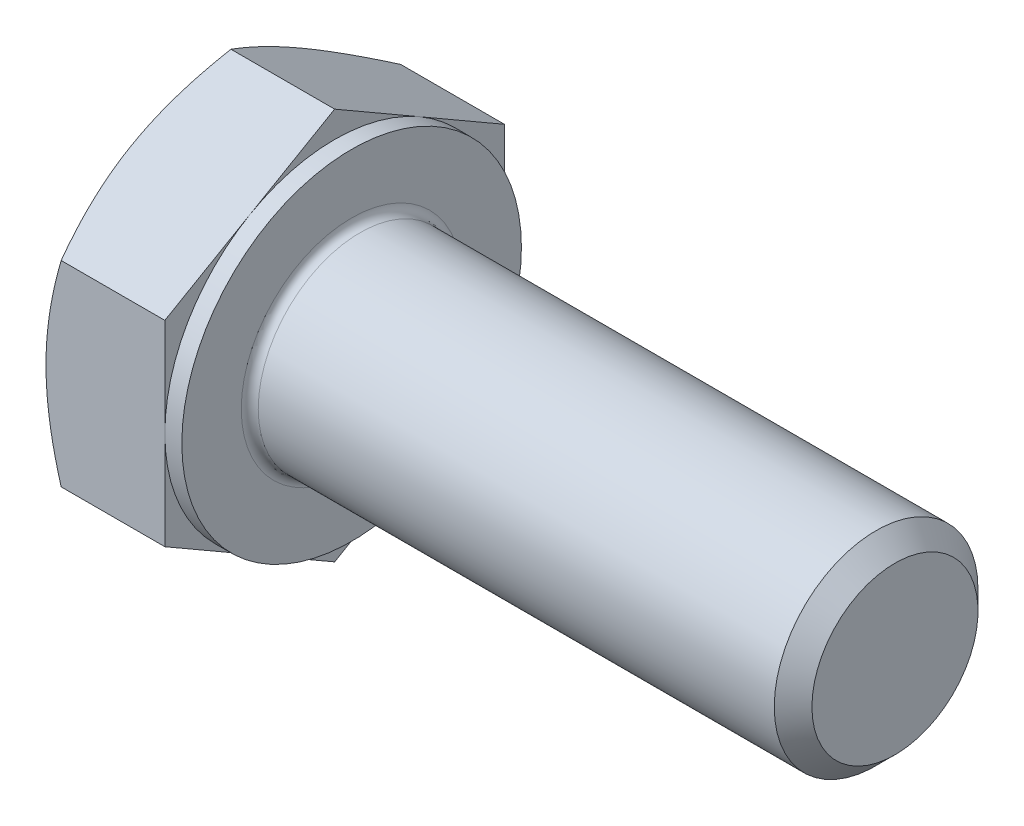
ISO-10303-21;
HEADER;
FILE_DESCRIPTION(('STEP AP214'),'2;1');
FILE_NAME('part.step','',(''),(''),'','','');
FILE_SCHEMA(('AUTOMOTIVE_DESIGN { 1 0 10303 214 1 1 1 1 }'));
ENDSEC;
DATA;
#1=APPLICATION_CONTEXT('core data for automotive mechanical design processes');
#2=APPLICATION_PROTOCOL_DEFINITION('international standard','automotive_design',2000,#1);
#3=PRODUCT_CONTEXT('',#1,'mechanical');
#4=PRODUCT('Part','Part','',(#3));
#5=PRODUCT_RELATED_PRODUCT_CATEGORY('part','',(#4));
#6=PRODUCT_DEFINITION_FORMATION('','',#4);
#7=PRODUCT_DEFINITION_CONTEXT('part definition',#1,'design');
#8=PRODUCT_DEFINITION('design','',#6,#7);
#9=PRODUCT_DEFINITION_SHAPE('','',#8);
#10=(LENGTH_UNIT() NAMED_UNIT(*) SI_UNIT(.MILLI.,.METRE.));
#11=(NAMED_UNIT(*) PLANE_ANGLE_UNIT() SI_UNIT($,.RADIAN.));
#12=(NAMED_UNIT(*) SI_UNIT($,.STERADIAN.) SOLID_ANGLE_UNIT());
#13=UNCERTAINTY_MEASURE_WITH_UNIT(LENGTH_MEASURE(1.E-05),#10,'distance_accuracy_value','');
#14=(GEOMETRIC_REPRESENTATION_CONTEXT(3) GLOBAL_UNCERTAINTY_ASSIGNED_CONTEXT((#13)) GLOBAL_UNIT_ASSIGNED_CONTEXT((#10,
#11,#12)) REPRESENTATION_CONTEXT('',''));
#15=CARTESIAN_POINT('',(0.,0.,0.));
#16=DIRECTION('',(0.,0.,1.));
#17=DIRECTION('',(1.,0.,0.));
#18=AXIS2_PLACEMENT_3D('',#15,#16,#17);
#19=CARTESIAN_POINT('',(4.,5.77350269189626,0.));
#20=DIRECTION('',(1.,0.,0.));
#21=DIRECTION('',(0.,0.,-1.));
#22=AXIS2_PLACEMENT_3D('',#19,#20,#21);
#23=PLANE('',#22);
#24=CARTESIAN_POINT('',(4.,0.,0.));
#25=DIRECTION('',(1.,0.,0.));
#26=DIRECTION('',(0.,0.,-1.));
#27=AXIS2_PLACEMENT_3D('',#24,#25,#26);
#28=CIRCLE('',#27,3.25);
#29=CARTESIAN_POINT('',(4.,0.,-3.25));
#30=VERTEX_POINT('',#29);
#31=EDGE_CURVE('E48',#30,#30,#28,.F.);
#32=ORIENTED_EDGE('',*,*,#31,.T.);
#33=EDGE_LOOP('',(#32));
#34=FACE_BOUND('',#33,.T.);
#35=CARTESIAN_POINT('',(4.,0.,0.));
#36=DIRECTION('',(1.,0.,0.));
#37=DIRECTION('',(0.,0.,-1.));
#38=AXIS2_PLACEMENT_3D('',#35,#36,#37);
#39=CIRCLE('',#38,5.);
#40=CARTESIAN_POINT('',(4.,0.,-5.));
#41=VERTEX_POINT('',#40);
#42=EDGE_CURVE('E305',#41,#41,#39,.T.);
#43=ORIENTED_EDGE('',*,*,#42,.T.);
#44=EDGE_LOOP('',(#43));
#45=FACE_BOUND('',#44,.T.);
#46=ADVANCED_FACE('F40',(#34,#45),#23,.T.);
#47=CARTESIAN_POINT('',(0.,0.,0.));
#48=DIRECTION('',(-1.,0.,0.));
#49=DIRECTION('',(0.,0.,1.));
#50=AXIS2_PLACEMENT_3D('',#47,#48,#49);
#51=CYLINDRICAL_SURFACE('',#50,3.);
#52=CARTESIAN_POINT('',(4.25,0.,0.));
#53=DIRECTION('',(1.,0.,0.));
#54=DIRECTION('',(0.,0.,-1.));
#55=AXIS2_PLACEMENT_3D('',#52,#53,#54);
#56=CIRCLE('',#55,3.);
#57=CARTESIAN_POINT('',(4.25,0.,-3.));
#58=VERTEX_POINT('',#57);
#59=EDGE_CURVE('E11',#58,#58,#56,.T.);
#60=ORIENTED_EDGE('',*,*,#59,.T.);
#61=EDGE_LOOP('',(#60));
#62=FACE_BOUND('',#61,.T.);
#63=CARTESIAN_POINT('',(19.4455,0.,0.));
#64=DIRECTION('',(-1.,0.,0.));
#65=DIRECTION('',(0.,0.,1.));
#66=AXIS2_PLACEMENT_3D('',#63,#64,#65);
#67=CIRCLE('',#66,3.);
#68=CARTESIAN_POINT('',(19.4455,0.,3.));
#69=VERTEX_POINT('',#68);
#70=EDGE_CURVE('E284',#69,#69,#67,.T.);
#71=ORIENTED_EDGE('',*,*,#70,.T.);
#72=EDGE_LOOP('',(#71));
#73=FACE_BOUND('',#72,.T.);
#74=ADVANCED_FACE('F258',(#62,#73),#51,.T.);
#75=CARTESIAN_POINT('',(20.,0.,0.));
#76=DIRECTION('',(-1.,0.,0.));
#77=DIRECTION('',(0.,0.,1.));
#78=AXIS2_PLACEMENT_3D('',#75,#76,#77);
#79=CONICAL_SURFACE('',#78,2.4455,0.785398163397442);
#80=ORIENTED_EDGE('',*,*,#70,.F.);
#81=EDGE_LOOP('',(#80));
#82=FACE_BOUND('',#81,.T.);
#83=CARTESIAN_POINT('',(20.,0.,0.));
#84=DIRECTION('',(-1.,0.,0.));
#85=DIRECTION('',(0.,0.,1.));
#86=AXIS2_PLACEMENT_3D('',#83,#84,#85);
#87=CIRCLE('',#86,2.4455);
#88=CARTESIAN_POINT('',(20.,0.,2.4455));
#89=VERTEX_POINT('',#88);
#90=EDGE_CURVE('E282',#89,#89,#87,.T.);
#91=ORIENTED_EDGE('',*,*,#90,.T.);
#92=EDGE_LOOP('',(#91));
#93=FACE_BOUND('',#92,.T.);
#94=ADVANCED_FACE('F263',(#82,#93),#79,.T.);
#95=CARTESIAN_POINT('',(20.,0.,0.));
#96=DIRECTION('',(-1.,0.,0.));
#97=DIRECTION('',(0.,0.,1.));
#98=AXIS2_PLACEMENT_3D('',#95,#96,#97);
#99=PLANE('',#98);
#100=ORIENTED_EDGE('',*,*,#90,.F.);
#101=EDGE_LOOP('',(#100));
#102=FACE_BOUND('',#101,.T.);
#103=ADVANCED_FACE('F270',(#102),#99,.F.);
#104=CARTESIAN_POINT('',(3.5,5.,0.));
#105=DIRECTION('',(1.,0.,0.));
#106=DIRECTION('',(0.,0.,-1.));
#107=AXIS2_PLACEMENT_3D('',#104,#105,#106);
#108=PLANE('',#107);
#109=DIRECTION('',(0.,0.500000000000001,0.866025403784438));
#110=VECTOR('',#109,1.);
#111=CARTESIAN_POINT('',(3.5,2.88675134594812,-5.));
#112=LINE('',#111,#110);
#113=CARTESIAN_POINT('',(3.5,2.88675134594812,-5.));
#114=VERTEX_POINT('',#113);
#115=CARTESIAN_POINT('',(3.5,4.33012701892219,-2.50000000000001));
#116=VERTEX_POINT('',#115);
#117=EDGE_CURVE('E172',#114,#116,#112,.T.);
#118=ORIENTED_EDGE('',*,*,#117,.T.);
#119=CARTESIAN_POINT('',(3.5,0.,0.));
#120=DIRECTION('',(-1.,0.,0.));
#121=DIRECTION('',(0.,0.,1.));
#122=AXIS2_PLACEMENT_3D('',#119,#120,#121);
#123=CIRCLE('',#122,5.);
#124=CARTESIAN_POINT('',(3.5,0.,-5.));
#125=VERTEX_POINT('',#124);
#126=EDGE_CURVE('E55',#116,#125,#123,.T.);
#127=ORIENTED_EDGE('',*,*,#126,.T.);
#128=DIRECTION('',(0.,1.,0.));
#129=VECTOR('',#128,1.);
#130=CARTESIAN_POINT('',(3.5,2.88675134594812,-5.));
#131=LINE('',#130,#129);
#132=EDGE_CURVE('E308',#125,#114,#131,.T.);
#133=ORIENTED_EDGE('',*,*,#132,.T.);
#134=EDGE_LOOP('',(#118,#127,#133));
#135=FACE_BOUND('',#134,.T.);
#136=ADVANCED_FACE('F273',(#135),#108,.T.);
#137=CARTESIAN_POINT('',(3.5,5.77350269189626,0.));
#138=VERTEX_POINT('',#137);
#139=EDGE_CURVE('E170',#116,#138,#112,.T.);
#140=ORIENTED_EDGE('',*,*,#139,.T.);
#141=DIRECTION('',(0.,-0.500000000000001,0.866025403784438));
#142=VECTOR('',#141,1.);
#143=CARTESIAN_POINT('',(3.5,5.77350269189626,0.));
#144=LINE('',#143,#142);
#145=CARTESIAN_POINT('',(3.5,4.33012701892219,2.50000000000001));
#146=VERTEX_POINT('',#145);
#147=EDGE_CURVE('E169',#138,#146,#144,.T.);
#148=ORIENTED_EDGE('',*,*,#147,.T.);
#149=EDGE_CURVE('E158',#146,#116,#123,.T.);
#150=ORIENTED_EDGE('',*,*,#149,.T.);
#151=EDGE_LOOP('',(#140,#148,#150));
#152=FACE_BOUND('',#151,.T.);
#153=ADVANCED_FACE('F278',(#152),#108,.T.);
#154=CARTESIAN_POINT('',(3.5,2.88675134594812,5.));
#155=VERTEX_POINT('',#154);
#156=EDGE_CURVE('E137',#146,#155,#144,.T.);
#157=ORIENTED_EDGE('',*,*,#156,.T.);
#158=DIRECTION('',(0.,-1.,0.));
#159=VECTOR('',#158,1.);
#160=CARTESIAN_POINT('',(3.5,2.88675134594812,5.));
#161=LINE('',#160,#159);
#162=CARTESIAN_POINT('',(3.5,0.,5.));
#163=VERTEX_POINT('',#162);
#164=EDGE_CURVE('E131',#155,#163,#161,.T.);
#165=ORIENTED_EDGE('',*,*,#164,.T.);
#166=EDGE_CURVE('E135',#163,#146,#123,.T.);
#167=ORIENTED_EDGE('',*,*,#166,.T.);
#168=EDGE_LOOP('',(#157,#165,#167));
#169=FACE_BOUND('',#168,.T.);
#170=ADVANCED_FACE('F133',(#169),#108,.T.);
#171=CARTESIAN_POINT('',(3.5,-2.88675134594812,5.));
#172=VERTEX_POINT('',#171);
#173=EDGE_CURVE('E141',#163,#172,#161,.T.);
#174=ORIENTED_EDGE('',*,*,#173,.T.);
#175=DIRECTION('',(0.,-0.500000000000002,-0.866025403784437));
#176=VECTOR('',#175,1.);
#177=CARTESIAN_POINT('',(3.5,-5.77350269189626,0.));
#178=LINE('',#177,#176);
#179=CARTESIAN_POINT('',(3.5,-4.33012701892219,2.50000000000001));
#180=VERTEX_POINT('',#179);
#181=EDGE_CURVE('E148',#172,#180,#178,.T.);
#182=ORIENTED_EDGE('',*,*,#181,.T.);
#183=EDGE_CURVE('E145',#180,#163,#123,.T.);
#184=ORIENTED_EDGE('',*,*,#183,.T.);
#185=EDGE_LOOP('',(#174,#182,#184));
#186=FACE_BOUND('',#185,.T.);
#187=ADVANCED_FACE('F146',(#186),#108,.T.);
#188=CARTESIAN_POINT('',(3.5,-5.77350269189626,0.));
#189=VERTEX_POINT('',#188);
#190=EDGE_CURVE('E164',#180,#189,#178,.T.);
#191=ORIENTED_EDGE('',*,*,#190,.T.);
#192=DIRECTION('',(0.,0.5,-0.866025403784439));
#193=VECTOR('',#192,1.);
#194=CARTESIAN_POINT('',(3.5,-2.88675134594813,-5.));
#195=LINE('',#194,#193);
#196=CARTESIAN_POINT('',(3.5,-4.33012701892219,-2.5));
#197=VERTEX_POINT('',#196);
#198=EDGE_CURVE('E346',#189,#197,#195,.T.);
#199=ORIENTED_EDGE('',*,*,#198,.T.);
#200=EDGE_CURVE('E152',#197,#180,#123,.T.);
#201=ORIENTED_EDGE('',*,*,#200,.T.);
#202=EDGE_LOOP('',(#191,#199,#201));
#203=FACE_BOUND('',#202,.T.);
#204=ADVANCED_FACE('F347',(#203),#108,.T.);
#205=CARTESIAN_POINT('',(3.5,-2.88675134594814,-5.));
#206=VERTEX_POINT('',#205);
#207=EDGE_CURVE('E159',#197,#206,#195,.T.);
#208=ORIENTED_EDGE('',*,*,#207,.T.);
#209=EDGE_CURVE('E309',#206,#125,#131,.T.);
#210=ORIENTED_EDGE('',*,*,#209,.T.);
#211=EDGE_CURVE('E316',#125,#197,#123,.T.);
#212=ORIENTED_EDGE('',*,*,#211,.T.);
#213=EDGE_LOOP('',(#208,#210,#212));
#214=FACE_BOUND('',#213,.T.);
#215=ADVANCED_FACE('F279',(#214),#108,.T.);
#216=CARTESIAN_POINT('',(0.,0.,0.));
#217=DIRECTION('',(-1.,0.,0.));
#218=DIRECTION('',(0.,0.,1.));
#219=AXIS2_PLACEMENT_3D('',#216,#217,#218);
#220=CYLINDRICAL_SURFACE('',#219,5.);
#221=ORIENTED_EDGE('',*,*,#126,.F.);
#222=ORIENTED_EDGE('',*,*,#149,.F.);
#223=ORIENTED_EDGE('',*,*,#166,.F.);
#224=ORIENTED_EDGE('',*,*,#183,.F.);
#225=ORIENTED_EDGE('',*,*,#200,.F.);
#226=ORIENTED_EDGE('',*,*,#211,.F.);
#227=EDGE_LOOP('',(#221,#222,#223,#224,#225,#226));
#228=FACE_BOUND('',#227,.T.);
#229=ORIENTED_EDGE('',*,*,#42,.F.);
#230=EDGE_LOOP('',(#229));
#231=FACE_BOUND('',#230,.T.);
#232=ADVANCED_FACE('F155',(#228,#231),#220,.T.);
#233=CARTESIAN_POINT('',(0.,5.77350269189626,0.));
#234=DIRECTION('',(1.,0.,0.));
#235=DIRECTION('',(0.,0.,-1.));
#236=AXIS2_PLACEMENT_3D('',#233,#234,#235);
#237=PLANE('',#236);
#238=CARTESIAN_POINT('',(0.,0.,0.));
#239=DIRECTION('',(1.,0.,0.));
#240=DIRECTION('',(0.,0.,-1.));
#241=AXIS2_PLACEMENT_3D('',#238,#239,#240);
#242=CIRCLE('',#241,5.);
#243=CARTESIAN_POINT('',(0.,0.,-5.));
#244=VERTEX_POINT('',#243);
#245=CARTESIAN_POINT('',(0.,4.33012701892219,-2.50000000000001));
#246=VERTEX_POINT('',#245);
#247=EDGE_CURVE('E304',#244,#246,#242,.T.);
#248=ORIENTED_EDGE('',*,*,#247,.F.);
#249=CARTESIAN_POINT('',(0.,-4.33012701892219,-2.5));
#250=VERTEX_POINT('',#249);
#251=EDGE_CURVE('E300',#250,#244,#242,.T.);
#252=ORIENTED_EDGE('',*,*,#251,.F.);
#253=CARTESIAN_POINT('',(0.,-4.33012701892219,2.50000000000001));
#254=VERTEX_POINT('',#253);
#255=EDGE_CURVE('E303',#254,#250,#242,.T.);
#256=ORIENTED_EDGE('',*,*,#255,.F.);
#257=CARTESIAN_POINT('',(0.,0.,5.));
#258=VERTEX_POINT('',#257);
#259=EDGE_CURVE('E339',#258,#254,#242,.T.);
#260=ORIENTED_EDGE('',*,*,#259,.F.);
#261=CARTESIAN_POINT('',(0.,0.,0.));
#262=DIRECTION('',(-1.,0.,0.));
#263=DIRECTION('',(0.,0.,1.));
#264=AXIS2_PLACEMENT_3D('',#261,#262,#263);
#265=CIRCLE('',#264,5.);
#266=CARTESIAN_POINT('',(0.,4.33012701892219,2.50000000000001));
#267=VERTEX_POINT('',#266);
#268=EDGE_CURVE('E173',#258,#267,#265,.T.);
#269=ORIENTED_EDGE('',*,*,#268,.T.);
#270=EDGE_CURVE('E362',#246,#267,#242,.T.);
#271=ORIENTED_EDGE('',*,*,#270,.F.);
#272=EDGE_LOOP('',(#248,#252,#256,#260,#269,#271));
#273=FACE_BOUND('',#272,.T.);
#274=ADVANCED_FACE('F204',(#273),#237,.F.);
#275=CARTESIAN_POINT('',(0.,0.,0.));
#276=DIRECTION('',(1.,0.,0.));
#277=DIRECTION('',(0.,0.,-1.));
#278=AXIS2_PLACEMENT_3D('',#275,#276,#277);
#279=CONICAL_SURFACE('',#278,5.,1.0471975511966);
#280=CARTESIAN_POINT('',(0.446648656051827,2.88663587589429,5.0002));
#281=CARTESIAN_POINT('',(0.373386567637633,3.01349970319368,4.78046540547482));
#282=CARTESIAN_POINT('',(0.30675132191809,3.14144859993849,4.55885141554042));
#283=CARTESIAN_POINT('',(0.19043899101081,3.3995619353212,4.11178600454649));
#284=CARTESIAN_POINT('',(0.140803049915788,3.52973095989717,3.88632664040923));
#285=CARTESIAN_POINT('',(0.0635510254186975,3.78847564779797,3.43816769477649));
#286=CARTESIAN_POINT('',(0.0354203782834891,3.91701101576052,3.21553790689581));
#287=CARTESIAN_POINT('',(0.0101949219536842,4.11026620624322,2.88081009815336));
#288=CARTESIAN_POINT('',(0.00461345976948367,4.17472868879311,2.76915780319494));
#289=CARTESIAN_POINT('',(-0.000797783248530101,4.30371322717528,2.5457500293262));
#290=CARTESIAN_POINT('',(-0.000627741741796917,4.36823528110589,2.43399455370969));
#291=CARTESIAN_POINT('',(0.00775363179203665,4.54500768479194,2.12781576914936));
#292=CARTESIAN_POINT('',(0.0218297718972523,4.65719946015292,1.93349391403279));
#293=CARTESIAN_POINT('',(0.0664652571094321,4.88083840557981,1.54613989800229));
#294=CARTESIAN_POINT('',(0.0970398601475091,4.9922847895602,1.35310909862843));
#295=CARTESIAN_POINT('',(0.173468493621165,5.21637431361295,0.964974657525146));
#296=CARTESIAN_POINT('',(0.219646378878682,5.32898917185759,0.769920001358264));
#297=CARTESIAN_POINT('',(0.324451794491936,5.55253939626498,0.382719654641231));
#298=CARTESIAN_POINT('',(0.383054703437377,5.66347762579592,0.190569004591913));
#299=CARTESIAN_POINT('',(0.446648656051831,5.7736181619501,-0.000200000000000734));
#300=B_SPLINE_CURVE_WITH_KNOTS('',3,(#280,#281,#282,#283,#284,#285,#286,#287,#288,#289,#290,
#291,#292,#293,#294,#295,#296,#297,#298,#299),.UNSPECIFIED.,.F.,.F.,(4,2,2,2,2,2,2,2,2,4),(0.,
0.792555841363091,1.58701660053333,2.3618153748728,2.74884076077325,3.13585419177295,
3.80962362599679,4.48401723901189,5.17336882348929,5.86136694793726),.UNSPECIFIED.);
#301=CARTESIAN_POINT('',(0.446581987385204,5.77350269189626,0.));
#302=VERTEX_POINT('',#301);
#303=EDGE_CURVE('E224',#267,#302,#300,.T.);
#304=ORIENTED_EDGE('',*,*,#303,.T.);
#305=CARTESIAN_POINT('',(0.446648656051831,5.7736181619501,0.000199999999999986));
#306=CARTESIAN_POINT('',(0.373386567637636,5.64675433465071,-0.219534594525184));
#307=CARTESIAN_POINT('',(0.306751321918093,5.5188054379059,-0.44114858445958));
#308=CARTESIAN_POINT('',(0.190438991010812,5.26069210252318,-0.888213995453513));
#309=CARTESIAN_POINT('',(0.14080304991579,5.13052307794721,-1.11367335959077));
#310=CARTESIAN_POINT('',(0.0635510254186987,4.87177839004641,-1.56183230522351));
#311=CARTESIAN_POINT('',(0.0354203782834898,4.74324302208387,-1.78446209310419));
#312=CARTESIAN_POINT('',(0.0101949219536844,4.54998783160116,-2.11918990184664));
#313=CARTESIAN_POINT('',(0.00461345976948374,4.48552534905128,-2.23084219680506));
#314=CARTESIAN_POINT('',(-0.000797783248530163,4.35654081066911,-2.4542499706738));
#315=CARTESIAN_POINT('',(-0.000627741741796996,4.2920187567385,-2.56600544629031));
#316=CARTESIAN_POINT('',(0.0077536317920361,4.11524635305244,-2.87218423085064));
#317=CARTESIAN_POINT('',(0.021829771897251,4.00305457769146,-3.06650608596721));
#318=CARTESIAN_POINT('',(0.06646525710943,3.77941563226457,-3.4538601019977));
#319=CARTESIAN_POINT('',(0.0970398601475071,3.66796924828418,-3.64689090137157));
#320=CARTESIAN_POINT('',(0.173468493621162,3.44387972423144,-4.03502534247485));
#321=CARTESIAN_POINT('',(0.219646378878679,3.3312648659868,-4.23007999864174));
#322=CARTESIAN_POINT('',(0.324451794491933,3.1077146415794,-4.61728034535877));
#323=CARTESIAN_POINT('',(0.383054703437373,2.99677641204846,-4.80943099540809));
#324=CARTESIAN_POINT('',(0.446648656051827,2.88663587589429,-5.0002));
#325=B_SPLINE_CURVE_WITH_KNOTS('',3,(#305,#306,#307,#308,#309,#310,#311,#312,#313,#314,#315,
#316,#317,#318,#319,#320,#321,#322,#323,#324),.UNSPECIFIED.,.F.,.F.,(4,2,2,2,2,2,2,2,2,4),(0.,
0.792555841363091,1.58701660053334,2.36181537487281,2.74884076077326,3.13585419177295,
3.80962362599679,4.48401723901189,5.17336882348929,5.86136694793726),.UNSPECIFIED.);
#326=EDGE_CURVE('E63',#302,#246,#325,.T.);
#327=ORIENTED_EDGE('',*,*,#326,.T.);
#328=ORIENTED_EDGE('',*,*,#270,.T.);
#329=EDGE_LOOP('',(#304,#327,#328));
#330=FACE_BOUND('',#329,.T.);
#331=ADVANCED_FACE('F363',(#330),#279,.T.);
#332=CARTESIAN_POINT('',(2.47533544689295,-7.82661640313889,5.));
#333=CARTESIAN_POINT('',(2.36879683507773,-7.60758613024921,5.));
#334=CARTESIAN_POINT('',(2.26325911833056,-7.3880607136441,5.));
#335=CARTESIAN_POINT('',(2.0547470786595,-6.94775649535433,5.));
#336=CARTESIAN_POINT('',(1.95177314617002,-6.72697750897688,5.));
#337=CARTESIAN_POINT('',(1.74844778545275,-6.28280027125597,5.));
#338=CARTESIAN_POINT('',(1.64811306490869,-6.05939434592713,5.));
#339=CARTESIAN_POINT('',(1.45145486004312,-5.6108304383292,5.));
#340=CARTESIAN_POINT('',(1.35513119080617,-5.38567253739805,5.));
#341=CARTESIAN_POINT('',(1.1644503760596,-4.92576614780202,5.));
#342=CARTESIAN_POINT('',(1.07026351405995,-4.69094667859484,5.));
#343=CARTESIAN_POINT('',(0.888844387350835,-4.21858752735362,5.));
#344=CARTESIAN_POINT('',(0.801612892640658,-3.98104754746317,5.));
#345=CARTESIAN_POINT('',(0.636341071883238,-3.50329086404363,5.));
#346=CARTESIAN_POINT('',(0.558282765149709,-3.26308044250486,5.));
#347=CARTESIAN_POINT('',(0.413813856737663,-2.77921467819531,5.));
#348=CARTESIAN_POINT('',(0.347399663631973,-2.53556042275999,5.));
#349=CARTESIAN_POINT('',(0.22970745053505,-2.04600448312503,5.));
#350=CARTESIAN_POINT('',(0.178346573442477,-1.80012308686183,5.));
#351=CARTESIAN_POINT('',(0.0936230804935142,-1.30522837494365,5.));
#352=CARTESIAN_POINT('',(0.0602585789244918,-1.05621539022477,5.));
#353=CARTESIAN_POINT('',(0.014622993380484,-0.559584253783065,5.));
#354=CARTESIAN_POINT('',(0.00207498506584041,-0.311992192967672,5.));
#355=CARTESIAN_POINT('',(-0.00159747165030555,0.18337558405674,5.));
#356=CARTESIAN_POINT('',(0.00727849448086243,0.431151303726643,5.));
#357=CARTESIAN_POINT('',(0.0397265053205845,0.84962286075823,5.));
#358=CARTESIAN_POINT('',(0.0579847912618799,1.02075746544157,5.));
#359=CARTESIAN_POINT('',(0.103624049996723,1.3618139875752,5.));
#360=CARTESIAN_POINT('',(0.131006199082925,1.53173574577271,5.));
#361=CARTESIAN_POINT('',(0.225403333816323,2.03942834541587,5.));
#362=CARTESIAN_POINT('',(0.304653621104037,2.37495177168563,5.));
#363=CARTESIAN_POINT('',(0.442611792168641,2.87686006020152,5.));
#364=CARTESIAN_POINT('',(0.492453035928118,3.04583048582565,5.));
#365=CARTESIAN_POINT('',(0.597441969480142,3.38213061038659,5.));
#366=CARTESIAN_POINT('',(0.652589698776807,3.5494602970987,5.));
#367=CARTESIAN_POINT('',(0.767295730006399,3.88253122341817,5.));
#368=CARTESIAN_POINT('',(0.826852713137816,4.04827292137365,5.));
#369=CARTESIAN_POINT('',(0.949663499110053,4.37837269604184,5.));
#370=CARTESIAN_POINT('',(1.01291722636637,4.54273080096526,5.));
#371=CARTESIAN_POINT('',(1.18384085306905,4.9746759403977,5.));
#372=CARTESIAN_POINT('',(1.29410564783453,5.24123504256649,5.));
#373=CARTESIAN_POINT('',(1.52085041203993,5.77170603526335,5.));
#374=CARTESIAN_POINT('',(1.63733099805397,6.03561766007929,5.));
#375=CARTESIAN_POINT('',(1.87507624393349,6.56138078778338,5.));
#376=CARTESIAN_POINT('',(1.99634255328238,6.82323154239329,5.));
#377=CARTESIAN_POINT('',(2.24254703861693,7.34518395602016,5.));
#378=CARTESIAN_POINT('',(2.36748508200602,7.60528567778375,5.));
#379=CARTESIAN_POINT('',(2.62044102887898,8.12446478659922,5.));
#380=CARTESIAN_POINT('',(2.74846325062126,8.38354006552433,5.));
#381=CARTESIAN_POINT('',(3.00682668967549,8.90053291127541,5.));
#382=CARTESIAN_POINT('',(3.13716793074432,9.15845046620729,5.));
#383=CARTESIAN_POINT('',(3.53092424591317,9.93067662274979,5.));
#384=CARTESIAN_POINT('',(3.79712405172275,10.4435647238032,5.));
#385=CARTESIAN_POINT('',(4.30724046881171,11.4147548711532,5.));
#386=CARTESIAN_POINT('',(4.55067498762245,11.873311348306,5.));
#387=CARTESIAN_POINT('',(5.04052915785298,12.7888590468283,5.));
#388=CARTESIAN_POINT('',(5.28694897482744,13.2458501795696,5.));
#389=CARTESIAN_POINT('',(5.7812250534644,14.1571829390173,5.));
#390=CARTESIAN_POINT('',(6.02907430461245,14.6115283739736,5.));
#391=CARTESIAN_POINT('',(6.5264818551985,15.5192398746589,5.));
#392=CARTESIAN_POINT('',(6.77604002809907,15.9726060096992,5.));
#393=CARTESIAN_POINT('',(7.02622264559118,16.4256251044156,5.));
#394=B_SPLINE_CURVE_WITH_KNOTS('',3,(#332,#333,#334,#335,#336,#337,#338,#339,#340,#341,#342,
#343,#344,#345,#346,#347,#348,#349,#350,#351,#352,#353,#354,#355,#356,#357,#358,#359,#360,#361,
#362,#363,#364,#365,#366,#367,#368,#369,#370,#371,#372,#373,#374,#375,#376,#377,#378,#379,#380,
#381,#382,#383,#384,#385,#386,#387,#388,#389,#390,#391,#392,#393),.UNSPECIFIED.,.F.,.F.,(4,2,2,
2,2,2,2,2,2,2,2,2,2,2,2,2,2,2,2,2,2,2,2,2,2,2,2,2,2,2,4),(0.,0.730708682143098,1.4615279703375,
2.19620403652928,2.930846195478,3.68977491658213,4.44878753915767,5.20628666210828,
5.9635517348485,6.71656679485872,7.46950293642267,8.21233991237299,8.95519126159773,
9.47125991232469,9.98739512288342,11.0201893937443,11.5486465414698,12.0771076235976,
12.6054112774226,13.1337041332035,13.9989833719716,14.8643486020619,15.7300147459346,
16.5956496665091,17.4625765068272,18.3295122333794,20.0630293163822,21.6205191219182,
23.1780956996636,24.7307447704824,26.2832800921358),.UNSPECIFIED.);
#395=CARTESIAN_POINT('',(0.4465819873852,2.88675134594812,5.));
#396=VERTEX_POINT('',#395);
#397=EDGE_CURVE('E238',#258,#396,#394,.T.);
#398=ORIENTED_EDGE('',*,*,#397,.T.);
#399=EDGE_CURVE('E237',#396,#267,#300,.T.);
#400=ORIENTED_EDGE('',*,*,#399,.T.);
#401=ORIENTED_EDGE('',*,*,#268,.F.);
#402=EDGE_LOOP('',(#398,#400,#401));
#403=FACE_BOUND('',#402,.T.);
#404=ADVANCED_FACE('F333',(#403),#279,.T.);
#405=CARTESIAN_POINT('',(0.446581987385199,-2.88675134594812,5.));
#406=VERTEX_POINT('',#405);
#407=EDGE_CURVE('E285',#406,#258,#394,.T.);
#408=ORIENTED_EDGE('',*,*,#407,.T.);
#409=ORIENTED_EDGE('',*,*,#259,.T.);
#410=CARTESIAN_POINT('',(0.446648656051832,-5.7736181619501,-0.000200000000000053));
#411=CARTESIAN_POINT('',(0.373386567637638,-5.64675433465071,0.219534594525185));
#412=CARTESIAN_POINT('',(0.306751321918095,-5.5188054379059,0.441148584459581));
#413=CARTESIAN_POINT('',(0.190438991010813,-5.26069210252318,0.888213995453513));
#414=CARTESIAN_POINT('',(0.140803049915791,-5.13052307794721,1.11367335959077));
#415=CARTESIAN_POINT('',(0.063551025418699,-4.87177839004641,1.56183230522351));
#416=CARTESIAN_POINT('',(0.03542037828349,-4.74324302208387,1.78446209310419));
#417=CARTESIAN_POINT('',(0.0101949219536843,-4.54998783160116,2.11918990184664));
#418=CARTESIAN_POINT('',(0.00461345976948345,-4.48552534905128,2.23084219680506));
#419=CARTESIAN_POINT('',(-0.000797783248530365,-4.35654081066911,2.4542499706738));
#420=CARTESIAN_POINT('',(-0.000627741741796937,-4.2920187567385,2.56600544629031));
#421=CARTESIAN_POINT('',(0.00775363179203635,-4.11524635305244,2.87218423085064));
#422=CARTESIAN_POINT('',(0.0218297718972508,-4.00305457769146,3.06650608596721));
#423=CARTESIAN_POINT('',(0.0664652571094294,-3.77941563226457,3.4538601019977));
#424=CARTESIAN_POINT('',(0.0970398601475065,-3.66796924828418,3.64689090137157));
#425=CARTESIAN_POINT('',(0.173468493621162,-3.44387972423143,4.03502534247485));
#426=CARTESIAN_POINT('',(0.219646378878678,-3.33126486598679,4.23007999864174));
#427=CARTESIAN_POINT('',(0.324451794491932,-3.1077146415794,4.61728034535877));
#428=CARTESIAN_POINT('',(0.383054703437371,-2.99677641204846,4.80943099540809));
#429=CARTESIAN_POINT('',(0.446648656051825,-2.88663587589428,5.0002));
#430=B_SPLINE_CURVE_WITH_KNOTS('',3,(#410,#411,#412,#413,#414,#415,#416,#417,#418,#419,#420,
#421,#422,#423,#424,#425,#426,#427,#428,#429),.UNSPECIFIED.,.F.,.F.,(4,2,2,2,2,2,2,2,2,4),(0.,
0.792555841363092,1.58701660053334,2.36181537487281,2.74884076077326,3.13585419177295,
3.8096236259968,4.4840172390119,5.17336882348929,5.86136694793726),.UNSPECIFIED.);
#431=EDGE_CURVE('E226',#254,#406,#430,.T.);
#432=ORIENTED_EDGE('',*,*,#431,.T.);
#433=EDGE_LOOP('',(#408,#409,#432));
#434=FACE_BOUND('',#433,.T.);
#435=ADVANCED_FACE('F193',(#434),#279,.T.);
#436=CARTESIAN_POINT('',(0.446581987385206,-5.77350269189626,0.));
#437=VERTEX_POINT('',#436);
#438=EDGE_CURVE('E218',#437,#254,#430,.T.);
#439=ORIENTED_EDGE('',*,*,#438,.T.);
#440=ORIENTED_EDGE('',*,*,#255,.T.);
#441=CARTESIAN_POINT('',(0.44664865605183,-2.8866358758943,-5.0002));
#442=CARTESIAN_POINT('',(0.373386567637636,-3.01349970319369,-4.78046540547482));
#443=CARTESIAN_POINT('',(0.306751321918093,-3.1414485999385,-4.55885141554042));
#444=CARTESIAN_POINT('',(0.190438991010813,-3.39956193532121,-4.11178600454649));
#445=CARTESIAN_POINT('',(0.140803049915791,-3.52973095989718,-3.88632664040923));
#446=CARTESIAN_POINT('',(0.0635510254187004,-3.78847564779798,-3.43816769477649));
#447=CARTESIAN_POINT('',(0.0354203782834919,-3.91701101576052,-3.21553790689581));
#448=CARTESIAN_POINT('',(0.0101949219536874,-4.11026620624323,-2.88081009815336));
#449=CARTESIAN_POINT('',(0.00461345976948698,-4.17472868879311,-2.76915780319494));
#450=CARTESIAN_POINT('',(-0.000797783248526409,-4.30371322717528,-2.5457500293262));
#451=CARTESIAN_POINT('',(-0.000627741741793026,-4.36823528110589,-2.43399455370968));
#452=CARTESIAN_POINT('',(0.0077536317920405,-4.54500768479195,-2.12781576914936));
#453=CARTESIAN_POINT('',(0.0218297718972554,-4.65719946015293,-1.93349391403278));
#454=CARTESIAN_POINT('',(0.0664652571094348,-4.88083840557982,-1.54613989800229));
#455=CARTESIAN_POINT('',(0.0970398601475121,-4.99228478956021,-1.35310909862843));
#456=CARTESIAN_POINT('',(0.173468493621168,-5.21637431361295,-0.964974657525145));
#457=CARTESIAN_POINT('',(0.219646378878684,-5.32898917185759,-0.769920001358263));
#458=CARTESIAN_POINT('',(0.324451794491938,-5.55253939626499,-0.382719654641231));
#459=CARTESIAN_POINT('',(0.383054703437378,-5.66347762579592,-0.190569004591913));
#460=CARTESIAN_POINT('',(0.446648656051832,-5.7736181619501,0.000200000000000639));
#461=B_SPLINE_CURVE_WITH_KNOTS('',3,(#441,#442,#443,#444,#445,#446,#447,#448,#449,#450,#451,
#452,#453,#454,#455,#456,#457,#458,#459,#460),.UNSPECIFIED.,.F.,.F.,(4,2,2,2,2,2,2,2,2,4),(0.,
0.79255584136309,1.58701660053333,2.36181537487281,2.74884076077325,3.13585419177295,
3.80962362599679,4.48401723901189,5.17336882348929,5.86136694793725),.UNSPECIFIED.);
#462=EDGE_CURVE('E225',#250,#437,#461,.T.);
#463=ORIENTED_EDGE('',*,*,#462,.T.);
#464=EDGE_LOOP('',(#439,#440,#463));
#465=FACE_BOUND('',#464,.T.);
#466=ADVANCED_FACE('F361',(#465),#279,.T.);
#467=CARTESIAN_POINT('',(0.4465819873852,2.88675134594812,-5.));
#468=VERTEX_POINT('',#467);
#469=EDGE_CURVE('E227',#246,#468,#325,.T.);
#470=ORIENTED_EDGE('',*,*,#469,.T.);
#471=CARTESIAN_POINT('',(2.47533544689296,-7.82661640313891,-5.));
#472=CARTESIAN_POINT('',(2.36879683507773,-7.60758613024923,-5.));
#473=CARTESIAN_POINT('',(2.26325911833057,-7.38806071364412,-5.));
#474=CARTESIAN_POINT('',(2.05474707865951,-6.94775649535435,-5.));
#475=CARTESIAN_POINT('',(1.95177314617003,-6.7269775089769,-5.));
#476=CARTESIAN_POINT('',(1.74844778545275,-6.28280027125599,-5.));
#477=CARTESIAN_POINT('',(1.64811306490869,-6.05939434592714,-5.));
#478=CARTESIAN_POINT('',(1.45145486004312,-5.61083043832922,-5.));
#479=CARTESIAN_POINT('',(1.35513119080618,-5.38567253739806,-5.));
#480=CARTESIAN_POINT('',(1.16445037605961,-4.92576614780204,-5.));
#481=CARTESIAN_POINT('',(1.07026351405996,-4.69094667859486,-5.));
#482=CARTESIAN_POINT('',(0.888844387350842,-4.21858752735364,-5.));
#483=CARTESIAN_POINT('',(0.801612892640663,-3.98104754746318,-5.));
#484=CARTESIAN_POINT('',(0.636341071883243,-3.50329086404365,-5.));
#485=CARTESIAN_POINT('',(0.558282765149714,-3.26308044250488,-5.));
#486=CARTESIAN_POINT('',(0.413813856737668,-2.77921467819533,-5.));
#487=CARTESIAN_POINT('',(0.347399663631977,-2.53556042276,-5.));
#488=CARTESIAN_POINT('',(0.229707450535054,-2.04600448312504,-5.));
#489=CARTESIAN_POINT('',(0.178346573442481,-1.80012308686184,-5.));
#490=CARTESIAN_POINT('',(0.0936230804935165,-1.30522837494366,-5.));
#491=CARTESIAN_POINT('',(0.0602585789244934,-1.05621539022478,-5.));
#492=CARTESIAN_POINT('',(0.014622993380485,-0.559584253783075,-5.));
#493=CARTESIAN_POINT('',(0.0020749850658414,-0.311992192967682,-5.));
#494=CARTESIAN_POINT('',(-0.00159747165030502,0.183375584056731,-5.));
#495=CARTESIAN_POINT('',(0.00727849448086254,0.431151303726634,-5.));
#496=CARTESIAN_POINT('',(0.0397265053205839,0.849622860758221,-5.));
#497=CARTESIAN_POINT('',(0.0579847912618789,1.02075746544156,-5.));
#498=CARTESIAN_POINT('',(0.103624049996721,1.36181398757519,-5.));
#499=CARTESIAN_POINT('',(0.131006199082923,1.5317357457727,-5.));
#500=CARTESIAN_POINT('',(0.225403333816321,2.03942834541586,-5.));
#501=CARTESIAN_POINT('',(0.304653621104034,2.37495177168562,-5.));
#502=CARTESIAN_POINT('',(0.442611792168636,2.87686006020151,-5.));
#503=CARTESIAN_POINT('',(0.492453035928113,3.04583048582564,-5.));
#504=CARTESIAN_POINT('',(0.597441969480137,3.38213061038658,-5.));
#505=CARTESIAN_POINT('',(0.652589698776802,3.54946029709868,-5.));
#506=CARTESIAN_POINT('',(0.767295730006393,3.88253122341816,-5.));
#507=CARTESIAN_POINT('',(0.826852713137811,4.04827292137363,-5.));
#508=CARTESIAN_POINT('',(0.949663499110047,4.37837269604182,-5.));
#509=CARTESIAN_POINT('',(1.01291722636637,4.54273080096525,-5.));
#510=CARTESIAN_POINT('',(1.18384085306905,4.97467594039768,-5.));
#511=CARTESIAN_POINT('',(1.29410564783452,5.24123504256647,-5.));
#512=CARTESIAN_POINT('',(1.52085041203992,5.77170603526333,-5.));
#513=CARTESIAN_POINT('',(1.63733099805396,6.03561766007927,-5.));
#514=CARTESIAN_POINT('',(1.87507624393348,6.56138078778336,-5.));
#515=CARTESIAN_POINT('',(1.99634255328237,6.82323154239328,-5.));
#516=CARTESIAN_POINT('',(2.24254703861692,7.34518395602014,-5.));
#517=CARTESIAN_POINT('',(2.36748508200601,7.60528567778373,-5.));
#518=CARTESIAN_POINT('',(2.62044102887897,8.12446478659921,-5.));
#519=CARTESIAN_POINT('',(2.74846325062125,8.38354006552432,-5.));
#520=CARTESIAN_POINT('',(3.00682668967549,8.9005329112754,-5.));
#521=CARTESIAN_POINT('',(3.13716793074432,9.15845046620728,-5.));
#522=CARTESIAN_POINT('',(3.53092424591316,9.93067662274979,-5.));
#523=CARTESIAN_POINT('',(3.79712405172275,10.4435647238032,-5.));
#524=CARTESIAN_POINT('',(4.3072404688117,11.4147548711532,-5.));
#525=CARTESIAN_POINT('',(4.55067498762245,11.873311348306,-5.));
#526=CARTESIAN_POINT('',(5.04052915785298,12.7888590468283,-5.));
#527=CARTESIAN_POINT('',(5.28694897482743,13.2458501795696,-5.));
#528=CARTESIAN_POINT('',(5.7812250534644,14.1571829390173,-5.));
#529=CARTESIAN_POINT('',(6.02907430461245,14.6115283739736,-5.));
#530=CARTESIAN_POINT('',(6.5264818551985,15.5192398746589,-5.));
#531=CARTESIAN_POINT('',(6.77604002809907,15.9726060096992,-5.));
#532=CARTESIAN_POINT('',(7.02622264559118,16.4256251044156,-5.));
#533=B_SPLINE_CURVE_WITH_KNOTS('',3,(#471,#472,#473,#474,#475,#476,#477,#478,#479,#480,#481,
#482,#483,#484,#485,#486,#487,#488,#489,#490,#491,#492,#493,#494,#495,#496,#497,#498,#499,#500,
#501,#502,#503,#504,#505,#506,#507,#508,#509,#510,#511,#512,#513,#514,#515,#516,#517,#518,#519,
#520,#521,#522,#523,#524,#525,#526,#527,#528,#529,#530,#531,#532),.UNSPECIFIED.,.F.,.F.,(4,2,2,
2,2,2,2,2,2,2,2,2,2,2,2,2,2,2,2,2,2,2,2,2,2,2,2,2,2,2,4),(0.,0.730708682143099,1.46152797033751,
2.19620403652929,2.930846195478,3.68977491658213,4.44878753915767,5.20628666210828,
5.9635517348485,6.71656679485873,7.46950293642268,8.21233991237301,8.95519126159775,
9.4712599123247,9.98739512288343,11.0201893937443,11.5486465414698,12.0771076235976,
12.6054112774226,13.1337041332035,13.9989833719716,14.8643486020619,15.7300147459346,
16.5956496665091,17.4625765068272,18.3295122333794,20.0630293163822,21.6205191219182,
23.1780956996636,24.7307447704824,26.2832800921359),.UNSPECIFIED.);
#534=EDGE_CURVE('E185',#468,#244,#533,.F.);
#535=ORIENTED_EDGE('',*,*,#534,.T.);
#536=ORIENTED_EDGE('',*,*,#247,.T.);
#537=EDGE_LOOP('',(#470,#535,#536));
#538=FACE_BOUND('',#537,.T.);
#539=ADVANCED_FACE('F358',(#538),#279,.T.);
#540=CARTESIAN_POINT('',(0.446581987384949,-2.88675134594852,-5.));
#541=VERTEX_POINT('',#540);
#542=EDGE_CURVE('E186',#541,#250,#461,.T.);
#543=ORIENTED_EDGE('',*,*,#542,.T.);
#544=ORIENTED_EDGE('',*,*,#251,.T.);
#545=EDGE_CURVE('E176',#244,#541,#533,.F.);
#546=ORIENTED_EDGE('',*,*,#545,.T.);
#547=EDGE_LOOP('',(#543,#544,#546));
#548=FACE_BOUND('',#547,.T.);
#549=ADVANCED_FACE('F202',(#548),#279,.T.);
#550=CARTESIAN_POINT('',(4.,2.88675134594812,-5.));
#551=DIRECTION('',(0.,0.,1.));
#552=DIRECTION('',(1.,0.,0.));
#553=AXIS2_PLACEMENT_3D('',#550,#551,#552);
#554=PLANE('',#553);
#555=ORIENTED_EDGE('',*,*,#209,.F.);
#556=DIRECTION('',(-1.,0.,0.));
#557=VECTOR('',#556,1.);
#558=CARTESIAN_POINT('',(4.,-2.88675134594813,-5.));
#559=LINE('',#558,#557);
#560=EDGE_CURVE('E291',#206,#541,#559,.T.);
#561=ORIENTED_EDGE('',*,*,#560,.T.);
#562=ORIENTED_EDGE('',*,*,#545,.F.);
#563=ORIENTED_EDGE('',*,*,#534,.F.);
#564=DIRECTION('',(-1.,0.,0.));
#565=VECTOR('',#564,1.);
#566=CARTESIAN_POINT('',(4.,2.88675134594812,-5.));
#567=LINE('',#566,#565);
#568=EDGE_CURVE('E287',#114,#468,#567,.T.);
#569=ORIENTED_EDGE('',*,*,#568,.F.);
#570=ORIENTED_EDGE('',*,*,#132,.F.);
#571=EDGE_LOOP('',(#555,#561,#562,#563,#569,#570));
#572=FACE_BOUND('',#571,.T.);
#573=ADVANCED_FACE('F197',(#572),#554,.F.);
#574=CARTESIAN_POINT('',(4.,-2.88675134594813,-5.));
#575=DIRECTION('',(0.,0.866025403784439,0.5));
#576=DIRECTION('',(0.,-0.5,0.866025403784439));
#577=AXIS2_PLACEMENT_3D('',#574,#575,#576);
#578=PLANE('',#577);
#579=ORIENTED_EDGE('',*,*,#198,.F.);
#580=DIRECTION('',(-1.,0.,0.));
#581=VECTOR('',#580,1.);
#582=CARTESIAN_POINT('',(4.,-5.77350269189626,0.));
#583=LINE('',#582,#581);
#584=EDGE_CURVE('E293',#189,#437,#583,.T.);
#585=ORIENTED_EDGE('',*,*,#584,.T.);
#586=ORIENTED_EDGE('',*,*,#462,.F.);
#587=ORIENTED_EDGE('',*,*,#542,.F.);
#588=ORIENTED_EDGE('',*,*,#560,.F.);
#589=ORIENTED_EDGE('',*,*,#207,.F.);
#590=EDGE_LOOP('',(#579,#585,#586,#587,#588,#589));
#591=FACE_BOUND('',#590,.T.);
#592=ADVANCED_FACE('F201',(#591),#578,.F.);
#593=CARTESIAN_POINT('',(4.,-5.77350269189626,0.));
#594=DIRECTION('',(0.,0.866025403784438,-0.500000000000002));
#595=DIRECTION('',(0.,0.500000000000002,0.866025403784437));
#596=AXIS2_PLACEMENT_3D('',#593,#594,#595);
#597=PLANE('',#596);
#598=ORIENTED_EDGE('',*,*,#181,.F.);
#599=DIRECTION('',(-1.,0.,0.));
#600=VECTOR('',#599,1.);
#601=CARTESIAN_POINT('',(4.,-2.88675134594812,5.));
#602=LINE('',#601,#600);
#603=EDGE_CURVE('E163',#172,#406,#602,.T.);
#604=ORIENTED_EDGE('',*,*,#603,.T.);
#605=ORIENTED_EDGE('',*,*,#431,.F.);
#606=ORIENTED_EDGE('',*,*,#438,.F.);
#607=ORIENTED_EDGE('',*,*,#584,.F.);
#608=ORIENTED_EDGE('',*,*,#190,.F.);
#609=EDGE_LOOP('',(#598,#604,#605,#606,#607,#608));
#610=FACE_BOUND('',#609,.T.);
#611=ADVANCED_FACE('F209',(#610),#597,.F.);
#612=CARTESIAN_POINT('',(4.,2.88675134594812,5.));
#613=DIRECTION('',(0.,0.,-1.));
#614=DIRECTION('',(0.,1.,0.));
#615=AXIS2_PLACEMENT_3D('',#612,#613,#614);
#616=PLANE('',#615);
#617=ORIENTED_EDGE('',*,*,#164,.F.);
#618=DIRECTION('',(-1.,0.,0.));
#619=VECTOR('',#618,1.);
#620=CARTESIAN_POINT('',(4.,2.88675134594812,5.));
#621=LINE('',#620,#619);
#622=EDGE_CURVE('E296',#155,#396,#621,.T.);
#623=ORIENTED_EDGE('',*,*,#622,.T.);
#624=ORIENTED_EDGE('',*,*,#397,.F.);
#625=ORIENTED_EDGE('',*,*,#407,.F.);
#626=ORIENTED_EDGE('',*,*,#603,.F.);
#627=ORIENTED_EDGE('',*,*,#173,.F.);
#628=EDGE_LOOP('',(#617,#623,#624,#625,#626,#627));
#629=FACE_BOUND('',#628,.T.);
#630=ADVANCED_FACE('F161',(#629),#616,.F.);
#631=CARTESIAN_POINT('',(4.,5.77350269189626,0.));
#632=DIRECTION('',(0.,-0.866025403784438,-0.500000000000001));
#633=DIRECTION('',(0.,0.500000000000001,-0.866025403784438));
#634=AXIS2_PLACEMENT_3D('',#631,#632,#633);
#635=PLANE('',#634);
#636=ORIENTED_EDGE('',*,*,#147,.F.);
#637=DIRECTION('',(-1.,0.,0.));
#638=VECTOR('',#637,1.);
#639=CARTESIAN_POINT('',(4.,5.77350269189626,0.));
#640=LINE('',#639,#638);
#641=EDGE_CURVE('E298',#138,#302,#640,.T.);
#642=ORIENTED_EDGE('',*,*,#641,.T.);
#643=ORIENTED_EDGE('',*,*,#303,.F.);
#644=ORIENTED_EDGE('',*,*,#399,.F.);
#645=ORIENTED_EDGE('',*,*,#622,.F.);
#646=ORIENTED_EDGE('',*,*,#156,.F.);
#647=EDGE_LOOP('',(#636,#642,#643,#644,#645,#646));
#648=FACE_BOUND('',#647,.T.);
#649=ADVANCED_FACE('F244',(#648),#635,.F.);
#650=CARTESIAN_POINT('',(4.,2.88675134594812,-5.));
#651=DIRECTION('',(0.,-0.866025403784438,0.500000000000001));
#652=DIRECTION('',(0.,-0.500000000000001,-0.866025403784438));
#653=AXIS2_PLACEMENT_3D('',#650,#651,#652);
#654=PLANE('',#653);
#655=ORIENTED_EDGE('',*,*,#117,.F.);
#656=ORIENTED_EDGE('',*,*,#568,.T.);
#657=ORIENTED_EDGE('',*,*,#469,.F.);
#658=ORIENTED_EDGE('',*,*,#326,.F.);
#659=ORIENTED_EDGE('',*,*,#641,.F.);
#660=ORIENTED_EDGE('',*,*,#139,.F.);
#661=EDGE_LOOP('',(#655,#656,#657,#658,#659,#660));
#662=FACE_BOUND('',#661,.T.);
#663=ADVANCED_FACE('F247',(#662),#654,.F.);
#664=CARTESIAN_POINT('',(4.25,0.,0.));
#665=DIRECTION('',(1.,0.,0.));
#666=DIRECTION('',(0.,0.,-1.));
#667=AXIS2_PLACEMENT_3D('',#664,#665,#666);
#668=TOROIDAL_SURFACE('',#667,3.25,0.25);
#669=ORIENTED_EDGE('',*,*,#59,.F.);
#670=EDGE_LOOP('',(#669));
#671=FACE_BOUND('',#670,.T.);
#672=ORIENTED_EDGE('',*,*,#31,.F.);
#673=EDGE_LOOP('',(#672));
#674=FACE_BOUND('',#673,.T.);
#675=ADVANCED_FACE('F42',(#671,#674),#668,.F.);
#676=CLOSED_SHELL('',(#46,#74,#94,#103,#136,#153,#170,#187,#204,#215,#232,#274,#331,#404,#435,
#466,#539,#549,#573,#592,#611,#630,#649,#663,#675));
#677=MANIFOLD_SOLID_BREP('B2',#676);
#678=ADVANCED_BREP_SHAPE_REPRESENTATION('',(#18,#677),#14);
#679=SHAPE_DEFINITION_REPRESENTATION(#9,#678);
ENDSEC;
END-ISO-10303-21;
